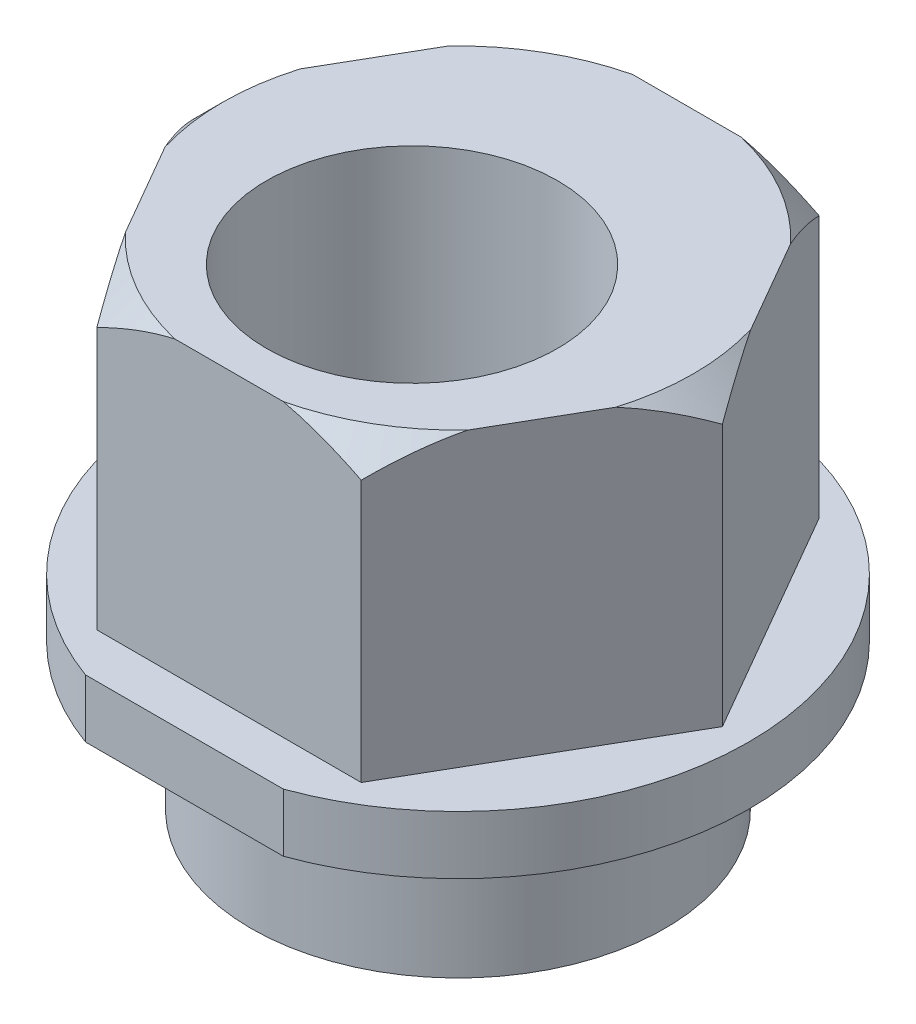
ISO-10303-21;
HEADER;
FILE_DESCRIPTION(('STEP AP214'),'2;1');
FILE_NAME('part.step','',(''),(''),'','','');
FILE_SCHEMA(('AUTOMOTIVE_DESIGN { 1 0 10303 214 1 1 1 1 }'));
ENDSEC;
DATA;
#1=APPLICATION_CONTEXT('core data for automotive mechanical design processes');
#2=APPLICATION_PROTOCOL_DEFINITION('international standard','automotive_design',2000,#1);
#3=PRODUCT_CONTEXT('',#1,'mechanical');
#4=PRODUCT('Part','Part','',(#3));
#5=PRODUCT_RELATED_PRODUCT_CATEGORY('part','',(#4));
#6=PRODUCT_DEFINITION_FORMATION('','',#4);
#7=PRODUCT_DEFINITION_CONTEXT('part definition',#1,'design');
#8=PRODUCT_DEFINITION('design','',#6,#7);
#9=PRODUCT_DEFINITION_SHAPE('','',#8);
#10=(LENGTH_UNIT() NAMED_UNIT(*) SI_UNIT(.MILLI.,.METRE.));
#11=(NAMED_UNIT(*) PLANE_ANGLE_UNIT() SI_UNIT($,.RADIAN.));
#12=(NAMED_UNIT(*) SI_UNIT($,.STERADIAN.) SOLID_ANGLE_UNIT());
#13=UNCERTAINTY_MEASURE_WITH_UNIT(LENGTH_MEASURE(1.E-05),#10,'distance_accuracy_value','');
#14=(GEOMETRIC_REPRESENTATION_CONTEXT(3) GLOBAL_UNCERTAINTY_ASSIGNED_CONTEXT((#13)) GLOBAL_UNIT_ASSIGNED_CONTEXT((#10,
#11,#12)) REPRESENTATION_CONTEXT('',''));
#15=CARTESIAN_POINT('',(0.,0.,0.));
#16=DIRECTION('',(0.,0.,1.));
#17=DIRECTION('',(1.,0.,0.));
#18=AXIS2_PLACEMENT_3D('',#15,#16,#17);
#19=CARTESIAN_POINT('',(0.,-1.,0.));
#20=DIRECTION('',(0.,1.,0.));
#21=DIRECTION('',(0.,0.,1.));
#22=AXIS2_PLACEMENT_3D('',#19,#20,#21);
#23=PLANE('',#22);
#24=CARTESIAN_POINT('',(0.,-1.,0.));
#25=DIRECTION('',(0.,1.,0.));
#26=DIRECTION('',(0.,0.,1.));
#27=AXIS2_PLACEMENT_3D('',#24,#25,#26);
#28=CIRCLE('',#27,5.);
#29=CARTESIAN_POINT('',(1.7,-1.,4.7021271782035));
#30=VERTEX_POINT('',#29);
#31=CARTESIAN_POINT('',(-1.7,-1.,4.7021271782035));
#32=VERTEX_POINT('',#31);
#33=EDGE_CURVE('E222',#30,#32,#28,.T.);
#34=ORIENTED_EDGE('',*,*,#33,.F.);
#35=DIRECTION('',(-1.,0.,0.));
#36=VECTOR('',#35,1.);
#37=CARTESIAN_POINT('',(0.,-1.,4.7021271782035));
#38=LINE('',#37,#36);
#39=EDGE_CURVE('E331',#30,#32,#38,.T.);
#40=ORIENTED_EDGE('',*,*,#39,.T.);
#41=EDGE_LOOP('',(#34,#40));
#42=FACE_BOUND('',#41,.T.);
#43=CARTESIAN_POINT('',(0.,-1.,0.));
#44=DIRECTION('',(0.,1.,0.));
#45=DIRECTION('',(0.,0.,1.));
#46=AXIS2_PLACEMENT_3D('',#43,#44,#45);
#47=CIRCLE('',#46,3.555);
#48=CARTESIAN_POINT('',(0.,-1.,3.555));
#49=VERTEX_POINT('',#48);
#50=EDGE_CURVE('E167',#49,#49,#47,.F.);
#51=ORIENTED_EDGE('',*,*,#50,.F.);
#52=EDGE_LOOP('',(#51));
#53=FACE_BOUND('',#52,.T.);
#54=ADVANCED_FACE('F35',(#42,#53),#23,.F.);
#55=CARTESIAN_POINT('',(2.27187330926118,5.,3.935));
#56=DIRECTION('',(-0.866025403784439,0.,-0.5));
#57=DIRECTION('',(-0.5,0.,0.866025403784439));
#58=AXIS2_PLACEMENT_3D('',#55,#56,#57);
#59=PLANE('',#58);
#60=DIRECTION('',(0.,-1.,0.));
#61=VECTOR('',#60,1.);
#62=CARTESIAN_POINT('',(4.54374661852235,5.,0.));
#63=LINE('',#62,#61);
#64=CARTESIAN_POINT('',(4.54374661852235,4.5,0.));
#65=VERTEX_POINT('',#64);
#66=CARTESIAN_POINT('',(4.54374661852235,0.,0.));
#67=VERTEX_POINT('',#66);
#68=EDGE_CURVE('E164',#65,#67,#63,.T.);
#69=ORIENTED_EDGE('',*,*,#68,.F.);
#70=CARTESIAN_POINT('',(6.12736327266163,2.33046829888115,-2.74290450468147));
#71=CARTESIAN_POINT('',(6.07348339276709,2.4177650828994,-2.64958181519841));
#72=CARTESIAN_POINT('',(6.01938921555573,2.50453762285222,-2.55588795187471));
#73=CARTESIAN_POINT('',(5.91069789973588,2.67683309661582,-2.36762907053321));
#74=CARTESIAN_POINT('',(5.85610071578471,2.76235591593962,-2.27306397397959));
#75=CARTESIAN_POINT('',(5.74620735938589,2.9321379387506,-2.08272309728255));
#76=CARTESIAN_POINT('',(5.6909098259844,3.01639362513631,-1.98694495989795));
#77=CARTESIAN_POINT('',(5.57966030231228,3.18315508159383,-1.79425513258));
#78=CARTESIAN_POINT('',(5.52370832991605,3.26566089928668,-1.69734347360602));
#79=CARTESIAN_POINT('',(5.40948255505868,3.43085092459455,-1.49949862801914));
#80=CARTESIAN_POINT('',(5.3511874452437,3.51347634106705,-1.3985285359868));
#81=CARTESIAN_POINT('',(5.23367321649109,3.67605365317037,-1.194987921175));
#82=CARTESIAN_POINT('',(5.17445413325307,3.75600565172091,-1.09241746022911));
#83=CARTESIAN_POINT('',(5.05499257757878,3.9125743398257,-0.885503976250002));
#84=CARTESIAN_POINT('',(4.99475102957391,3.98919384008597,-0.78116255437897));
#85=CARTESIAN_POINT('',(4.873034492307,4.1383918042904,-0.570343327711337));
#86=CARTESIAN_POINT('',(4.81155966257741,4.21097078637303,-0.463865799233039));
#87=CARTESIAN_POINT('',(4.68581480841085,4.35265115676022,-0.246069323026223));
#88=CARTESIAN_POINT('',(4.62151303943029,4.42164059850529,-0.134695392135335));
#89=CARTESIAN_POINT('',(4.4912183922476,4.55301635986169,0.090981556739347));
#90=CARTESIAN_POINT('',(4.42522527529575,4.61540174079966,0.205284988249787));
#91=CARTESIAN_POINT('',(4.29176890522431,4.73150823576122,0.436438201807242));
#92=CARTESIAN_POINT('',(4.22431561588303,4.78527468558276,0.553270726083977));
#93=CARTESIAN_POINT('',(4.08756303909753,4.88247623364584,0.790133137142428));
#94=CARTESIAN_POINT('',(4.01826431274338,4.92591443311341,0.910162052087628));
#95=CARTESIAN_POINT('',(3.89160680975576,4.99299560676046,1.129539282422));
#96=CARTESIAN_POINT('',(3.83454175212893,5.01884439579798,1.22837886156851));
#97=CARTESIAN_POINT('',(3.71955042243969,5.06126068823275,1.42754968702018));
#98=CARTESIAN_POINT('',(3.66162427680432,5.0778295405829,1.52788071434728));
#99=CARTESIAN_POINT('',(3.54536540774452,5.10083438466152,1.72924698238935));
#100=CARTESIAN_POINT('',(3.4870335640049,5.1072879053957,1.83028069944554));
#101=CARTESIAN_POINT('',(3.37031281221754,5.10976287991731,2.03244697183888));
#102=CARTESIAN_POINT('',(3.31192390350574,5.10578421082689,2.13357952832621));
#103=CARTESIAN_POINT('',(3.19571069696838,5.08764038060559,2.33486670655941));
#104=CARTESIAN_POINT('',(3.13788528988516,5.07350318473267,2.43502324959591));
#105=CARTESIAN_POINT('',(3.02300572590152,5.03579603444199,2.63400049116693));
#106=CARTESIAN_POINT('',(2.96595175572664,5.01222383709666,2.73282086628335));
#107=CARTESIAN_POINT('',(2.85271904802042,4.95661618256865,2.9289456691091));
#108=CARTESIAN_POINT('',(2.79654337792266,4.92455603960202,3.02624478386765));
#109=CARTESIAN_POINT('',(2.68537248742994,4.85318593152667,3.21879841452373));
#110=CARTESIAN_POINT('',(2.63037720983353,4.81387631861451,3.31405302949706));
#111=CARTESIAN_POINT('',(2.5019161833033,4.71383121159169,3.53655405423988));
#112=CARTESIAN_POINT('',(2.42896022795634,4.65048731772351,3.66291747561553));
#113=CARTESIAN_POINT('',(2.28511505424096,4.51496245516658,3.91206462491415));
#114=CARTESIAN_POINT('',(2.2142269607044,4.44277678394606,4.03484640457117));
#115=CARTESIAN_POINT('',(2.07416708594693,4.29140781010891,4.27743722375284));
#116=CARTESIAN_POINT('',(2.00499919286836,4.21221022636325,4.39723952881742));
#117=CARTESIAN_POINT('',(1.86828970424628,4.04847541244671,4.63402730898762));
#118=CARTESIAN_POINT('',(1.80074782327538,3.96393912900212,4.75101327846797));
#119=CARTESIAN_POINT('',(1.6667324101583,3.790255628053,4.9831347829841));
#120=CARTESIAN_POINT('',(1.60026513983173,3.70108917509827,5.09825947223014));
#121=CARTESIAN_POINT('',(1.46849790545969,3.51936003005431,5.32648701693534));
#122=CARTESIAN_POINT('',(1.40319803917282,3.42679705550268,5.43958970307165));
#123=CARTESIAN_POINT('',(1.27366225353528,3.23904020589262,5.66395226519422));
#124=CARTESIAN_POINT('',(1.20942525212282,3.14384930831284,5.77521401536649));
#125=CARTESIAN_POINT('',(1.08179181966025,2.9512386314917,5.99628160513605));
#126=CARTESIAN_POINT('',(1.01839540535985,2.85381880794148,6.10608741572204));
#127=CARTESIAN_POINT('',(0.910409016945997,2.6853578347565,6.2931253269807));
#128=CARTESIAN_POINT('',(0.865642352807006,2.61476846228915,6.3706634637548));
#129=CARTESIAN_POINT('',(0.776622094234247,2.47305833440251,6.52485107450574));
#130=CARTESIAN_POINT('',(0.732367142810404,2.40194099006958,6.60150289885833));
#131=CARTESIAN_POINT('',(0.688256655121896,2.33046829888115,6.67790450468147));
#132=B_SPLINE_CURVE_WITH_KNOTS('',3,(#70,#71,#72,#73,#74,#75,#76,#77,#78,#79,#80,#81,#82,#83,
#84,#85,#86,#87,#88,#89,#90,#91,#92,#93,#94,#95,#96,#97,#98,#99,#100,#101,#102,#103,#104,#105,
#106,#107,#108,#109,#110,#111,#112,#113,#114,#115,#116,#117,#118,#119,#120,#121,#122,#123,#124,
#125,#126,#127,#128,#129,#130,#131),.UNSPECIFIED.,.F.,.F.,(4,2,2,2,2,2,2,2,2,2,2,2,2,2,2,2,2,2,
2,2,2,2,2,2,2,2,2,2,2,2,4),(0.,0.416050988652375,0.832139855784054,1.24922530063749,
1.6662993802975,2.09496685038955,2.52361779884089,2.95189991005181,3.38012697311563,
3.81779500231414,4.25552515650994,4.69087140580247,5.12608676971888,5.4768138337239,
5.82748990199696,6.17755760407587,6.52762942952254,6.87674122143841,7.22593605499141,
7.5761578380004,7.92636261087879,8.40316579002672,8.88022366888807,9.35827656071276,
9.83624491486482,10.316388748245,10.7965726023688,11.2762330860941,11.7559031133002,
12.0979389750605,12.4385584137849),.UNSPECIFIED.);
#133=CARTESIAN_POINT('',(3.87355176865353,5.,1.1608115309438));
#134=VERTEX_POINT('',#133);
#135=EDGE_CURVE('E311',#65,#134,#132,.T.);
#136=ORIENTED_EDGE('',*,*,#135,.T.);
#137=DIRECTION('',(0.5,0.,-0.866025403784439));
#138=VECTOR('',#137,1.);
#139=CARTESIAN_POINT('',(2.27187330926118,5.,3.935));
#140=LINE('',#139,#138);
#141=CARTESIAN_POINT('',(2.94206815913,5.,2.7741884690562));
#142=VERTEX_POINT('',#141);
#143=EDGE_CURVE('E234',#142,#134,#140,.T.);
#144=ORIENTED_EDGE('',*,*,#143,.F.);
#145=CARTESIAN_POINT('',(2.27187330926118,4.5,3.935));
#146=VERTEX_POINT('',#145);
#147=EDGE_CURVE('E251',#142,#146,#132,.T.);
#148=ORIENTED_EDGE('',*,*,#147,.T.);
#149=DIRECTION('',(0.,-1.,0.));
#150=VECTOR('',#149,1.);
#151=CARTESIAN_POINT('',(2.27187330926118,5.,3.935));
#152=LINE('',#151,#150);
#153=CARTESIAN_POINT('',(2.27187330926118,0.,3.935));
#154=VERTEX_POINT('',#153);
#155=EDGE_CURVE('E218',#146,#154,#152,.T.);
#156=ORIENTED_EDGE('',*,*,#155,.T.);
#157=DIRECTION('',(0.5,0.,-0.866025403784439));
#158=VECTOR('',#157,1.);
#159=CARTESIAN_POINT('',(2.27187330926118,0.,3.935));
#160=LINE('',#159,#158);
#161=EDGE_CURVE('E219',#154,#67,#160,.T.);
#162=ORIENTED_EDGE('',*,*,#161,.T.);
#163=EDGE_LOOP('',(#69,#136,#144,#148,#156,#162));
#164=FACE_BOUND('',#163,.T.);
#165=ADVANCED_FACE('F37',(#164),#59,.F.);
#166=CARTESIAN_POINT('',(4.54374661852235,5.,0.));
#167=DIRECTION('',(-0.866025403784438,0.,0.5));
#168=DIRECTION('',(0.5,0.,0.866025403784438));
#169=AXIS2_PLACEMENT_3D('',#166,#167,#168);
#170=PLANE('',#169);
#171=DIRECTION('',(0.,-1.,0.));
#172=VECTOR('',#171,1.);
#173=CARTESIAN_POINT('',(2.27187330926118,5.,-3.935));
#174=LINE('',#173,#172);
#175=CARTESIAN_POINT('',(2.27187330926118,4.5,-3.935));
#176=VERTEX_POINT('',#175);
#177=CARTESIAN_POINT('',(2.27187330926118,0.,-3.935));
#178=VERTEX_POINT('',#177);
#179=EDGE_CURVE('E153',#176,#178,#174,.T.);
#180=ORIENTED_EDGE('',*,*,#179,.F.);
#181=CARTESIAN_POINT('',(0.688256655121894,2.33046829888116,-6.67790450468146));
#182=CARTESIAN_POINT('',(0.742136535016436,2.4177650828994,-6.58458181519841));
#183=CARTESIAN_POINT('',(0.796230712227795,2.50453762285222,-6.4908879518747));
#184=CARTESIAN_POINT('',(0.904922028047648,2.67683309661582,-6.3026290705332));
#185=CARTESIAN_POINT('',(0.959519211998818,2.76235591593963,-6.20806397397959));
#186=CARTESIAN_POINT('',(1.06941256839764,2.93213793875061,-6.01772309728255));
#187=CARTESIAN_POINT('',(1.12471010179913,3.01639362513632,-5.92194495989794));
#188=CARTESIAN_POINT('',(1.23595962547125,3.18315508159383,-5.72925513257999));
#189=CARTESIAN_POINT('',(1.29191159786749,3.26566089928668,-5.63234347360602));
#190=CARTESIAN_POINT('',(1.40613737272485,3.43085092459456,-5.43449862801913));
#191=CARTESIAN_POINT('',(1.46443248253983,3.51347634106706,-5.33352853598679));
#192=CARTESIAN_POINT('',(1.58194671129244,3.67605365317038,-5.12998792117499));
#193=CARTESIAN_POINT('',(1.64116579453046,3.75600565172092,-5.0274174602291));
#194=CARTESIAN_POINT('',(1.76062735020476,3.9125743398257,-4.82050397624999));
#195=CARTESIAN_POINT('',(1.82086889820963,3.98919384008598,-4.71616255437896));
#196=CARTESIAN_POINT('',(1.94258543547653,4.1383918042904,-4.50534332771133));
#197=CARTESIAN_POINT('',(2.00406026520612,4.21097078637303,-4.39886579923303));
#198=CARTESIAN_POINT('',(2.12980511937268,4.35265115676022,-4.18106932302621));
#199=CARTESIAN_POINT('',(2.19410688835324,4.4216405985053,-4.06969539213533));
#200=CARTESIAN_POINT('',(2.32440153553593,4.5530163598617,-3.84401844326064));
#201=CARTESIAN_POINT('',(2.39039465248778,4.61540174079966,-3.7297150117502));
#202=CARTESIAN_POINT('',(2.52385102255923,4.73150823576123,-3.49856179819275));
#203=CARTESIAN_POINT('',(2.5913043119005,4.78527468558276,-3.38172927391602));
#204=CARTESIAN_POINT('',(2.728056888686,4.88247623364584,-3.14486686285757));
#205=CARTESIAN_POINT('',(2.79735561504015,4.92591443311342,-3.02483794791237));
#206=CARTESIAN_POINT('',(2.92401311802778,4.99299560676046,-2.805460717578));
#207=CARTESIAN_POINT('',(2.98107817565461,5.01884439579799,-2.70662113843148));
#208=CARTESIAN_POINT('',(3.09606950534385,5.06126068823276,-2.50745031297981));
#209=CARTESIAN_POINT('',(3.15399565097922,5.0778295405829,-2.40711928565272));
#210=CARTESIAN_POINT('',(3.27025452003902,5.10083438466152,-2.20575301761065));
#211=CARTESIAN_POINT('',(3.32858636377864,5.1072879053957,-2.10471930055446));
#212=CARTESIAN_POINT('',(3.445307115566,5.10976287991731,-1.90255302816112));
#213=CARTESIAN_POINT('',(3.50369602427779,5.10578421082689,-1.80142047167379));
#214=CARTESIAN_POINT('',(3.61990923081515,5.08764038060559,-1.60013329344058));
#215=CARTESIAN_POINT('',(3.67773463789837,5.07350318473267,-1.49997675040409));
#216=CARTESIAN_POINT('',(3.79261420188202,5.03579603444199,-1.30099950883306));
#217=CARTESIAN_POINT('',(3.8496681720569,5.01222383709666,-1.20217913371665));
#218=CARTESIAN_POINT('',(3.96290087976311,4.95661618256865,-1.00605433089089));
#219=CARTESIAN_POINT('',(4.01907654986087,4.92455603960202,-0.908755216132345));
#220=CARTESIAN_POINT('',(4.13024744035359,4.85318593152667,-0.716201585476272));
#221=CARTESIAN_POINT('',(4.18524271795,4.81387631861451,-0.620946970502936));
#222=CARTESIAN_POINT('',(4.31370374448024,4.71383121159169,-0.398445945760117));
#223=CARTESIAN_POINT('',(4.38665969982719,4.6504873177235,-0.272082524384468));
#224=CARTESIAN_POINT('',(4.53050487354258,4.51496245516658,-0.0229353750858439));
#225=CARTESIAN_POINT('',(4.60139296707914,4.44277678394605,0.0998464045711766));
#226=CARTESIAN_POINT('',(4.74145284183661,4.2914078101089,0.342437223752842));
#227=CARTESIAN_POINT('',(4.81062073491518,4.21221022636324,0.462239528817422));
#228=CARTESIAN_POINT('',(4.94733022353726,4.0484754124467,0.699027308987622));
#229=CARTESIAN_POINT('',(5.01487210450815,3.96393912900211,0.81601327846798));
#230=CARTESIAN_POINT('',(5.14888751762524,3.79025562805299,1.04813478298411));
#231=CARTESIAN_POINT('',(5.21535478795181,3.70108917509827,1.16325947223014));
#232=CARTESIAN_POINT('',(5.34712202232385,3.5193600300543,1.39148701693534));
#233=CARTESIAN_POINT('',(5.41242188861072,3.42679705550267,1.50458970307166));
#234=CARTESIAN_POINT('',(5.54195767424825,3.23904020589262,1.72895226519422));
#235=CARTESIAN_POINT('',(5.60619467566072,3.14384930831283,1.84021401536649));
#236=CARTESIAN_POINT('',(5.73382810812329,2.95123863149169,2.06128160513606));
#237=CARTESIAN_POINT('',(5.79722452242369,2.85381880794147,2.17108741572204));
#238=CARTESIAN_POINT('',(5.90521091083754,2.68535783475649,2.3581253269807));
#239=CARTESIAN_POINT('',(5.94997757497653,2.61476846228915,2.43566346375481));
#240=CARTESIAN_POINT('',(6.03899783354929,2.47305833440251,2.58985107450574));
#241=CARTESIAN_POINT('',(6.08325278497313,2.40194099006958,2.66650289885833));
#242=CARTESIAN_POINT('',(6.12736327266164,2.33046829888115,2.74290450468146));
#243=B_SPLINE_CURVE_WITH_KNOTS('',3,(#181,#182,#183,#184,#185,#186,#187,#188,#189,#190,#191,
#192,#193,#194,#195,#196,#197,#198,#199,#200,#201,#202,#203,#204,#205,#206,#207,#208,#209,#210,
#211,#212,#213,#214,#215,#216,#217,#218,#219,#220,#221,#222,#223,#224,#225,#226,#227,#228,#229,
#230,#231,#232,#233,#234,#235,#236,#237,#238,#239,#240,#241,#242),.UNSPECIFIED.,.F.,.F.,(4,2,2,
2,2,2,2,2,2,2,2,2,2,2,2,2,2,2,2,2,2,2,2,2,2,2,2,2,2,2,4),(0.,0.416050988652376,
0.832139855784055,1.24922530063749,1.66629938029751,2.09496685038956,2.5236177988409,
2.95189991005182,3.38012697311563,3.81779500231415,4.25552515650994,4.69087140580247,
5.12608676971889,5.4768138337239,5.82748990199696,6.17755760407587,6.52762942952254,
6.87674122143841,7.22593605499141,7.57615783800039,7.92636261087879,8.40316579002672,
8.88022366888807,9.35827656071276,9.83624491486482,10.316388748245,10.7965726023688,
11.2762330860941,11.7559031133002,12.0979389750605,12.4385584137849),.UNSPECIFIED.);
#244=CARTESIAN_POINT('',(2.94206815913,5.,-2.7741884690562));
#245=VERTEX_POINT('',#244);
#246=EDGE_CURVE('E136',#176,#245,#243,.T.);
#247=ORIENTED_EDGE('',*,*,#246,.T.);
#248=DIRECTION('',(-0.5,0.,-0.866025403784438));
#249=VECTOR('',#248,1.);
#250=CARTESIAN_POINT('',(4.54374661852235,5.,0.));
#251=LINE('',#250,#249);
#252=CARTESIAN_POINT('',(3.87355176865353,5.,-1.1608115309438));
#253=VERTEX_POINT('',#252);
#254=EDGE_CURVE('E212',#253,#245,#251,.T.);
#255=ORIENTED_EDGE('',*,*,#254,.F.);
#256=EDGE_CURVE('E146',#253,#65,#243,.T.);
#257=ORIENTED_EDGE('',*,*,#256,.T.);
#258=ORIENTED_EDGE('',*,*,#68,.T.);
#259=DIRECTION('',(-0.5,0.,-0.866025403784438));
#260=VECTOR('',#259,1.);
#261=CARTESIAN_POINT('',(4.54374661852235,0.,0.));
#262=LINE('',#261,#260);
#263=EDGE_CURVE('E163',#67,#178,#262,.T.);
#264=ORIENTED_EDGE('',*,*,#263,.T.);
#265=EDGE_LOOP('',(#180,#247,#255,#257,#258,#264));
#266=FACE_BOUND('',#265,.T.);
#267=ADVANCED_FACE('F161',(#266),#170,.F.);
#268=CARTESIAN_POINT('',(2.27187330926118,5.,-3.935));
#269=DIRECTION('',(0.,0.,1.));
#270=DIRECTION('',(1.,0.,0.));
#271=AXIS2_PLACEMENT_3D('',#268,#269,#270);
#272=PLANE('',#271);
#273=DIRECTION('',(0.,-1.,0.));
#274=VECTOR('',#273,1.);
#275=CARTESIAN_POINT('',(-2.27187330926118,5.,-3.935));
#276=LINE('',#275,#274);
#277=CARTESIAN_POINT('',(-2.27187330926118,4.5,-3.935));
#278=VERTEX_POINT('',#277);
#279=CARTESIAN_POINT('',(-2.27187330926118,0.,-3.935));
#280=VERTEX_POINT('',#279);
#281=EDGE_CURVE('E165',#278,#280,#276,.T.);
#282=ORIENTED_EDGE('',*,*,#281,.F.);
#283=CARTESIAN_POINT('',(-5.01477781394264,2.6694057488158,-3.935));
#284=CARTESIAN_POINT('',(-4.90228240032233,2.75789162999437,-3.935));
#285=CARTESIAN_POINT('',(-4.78924605492269,2.84569863662638,-3.935));
#286=CARTESIAN_POINT('',(-4.56188241632701,3.01966288534844,-3.935));
#287=CARTESIAN_POINT('',(-4.44755491307628,3.10581985266844,-3.935));
#288=CARTESIAN_POINT('',(-4.21685222046402,3.27659538663721,-3.935));
#289=CARTESIAN_POINT('',(-4.10046957789372,3.36120391114583,-3.935));
#290=CARTESIAN_POINT('',(-3.86599418351296,3.52801066974508,-3.935));
#291=CARTESIAN_POINT('',(-3.74790151420127,3.61020901953759,-3.935));
#292=CARTESIAN_POINT('',(-3.50380543280417,3.77568927594522,-3.935));
#293=CARTESIAN_POINT('',(-3.3777005297054,3.85882204730453,-3.935));
#294=CARTESIAN_POINT('',(-3.12293409141574,4.0210686075328,-3.935));
#295=CARTESIAN_POINT('',(-2.99427277147477,4.10018273279293,-3.935));
#296=CARTESIAN_POINT('',(-2.7342134500717,4.25322326602883,-3.935));
#297=CARTESIAN_POINT('',(-2.60282112402671,4.32715926211431,-3.935));
#298=CARTESIAN_POINT('',(-2.33665993470769,4.46865096658867,-3.935));
#299=CARTESIAN_POINT('',(-2.20189200633557,4.53620841737975,-3.935));
#300=CARTESIAN_POINT('',(-1.94277039794665,4.65662539379787,-3.935));
#301=CARTESIAN_POINT('',(-1.81879024517606,4.7102827638368,-3.935));
#302=CARTESIAN_POINT('',(-1.56760322182998,4.80956431437058,-3.935));
#303=CARTESIAN_POINT('',(-1.4403960426367,4.8551877231961,-3.935));
#304=CARTESIAN_POINT('',(-1.18430895439847,4.93616339546024,-3.935));
#305=CARTESIAN_POINT('',(-1.05546474171029,4.97162701315895,-3.935));
#306=CARTESIAN_POINT('',(-0.795188728182397,5.03120060018271,-3.935));
#307=CARTESIAN_POINT('',(-0.663757985336443,5.05531511515621,-3.935));
#308=CARTESIAN_POINT('',(-0.39667530812576,5.09105643721047,-3.935));
#309=CARTESIAN_POINT('',(-0.260990364554486,5.10244193256667,-3.935));
#310=CARTESIAN_POINT('',(0.0108256286758382,5.11107629854814,-3.935));
#311=CARTESIAN_POINT('',(0.146956639108313,5.10832638056083,-3.935));
#312=CARTESIAN_POINT('',(0.418619878870053,5.08887050209526,-3.935));
#313=CARTESIAN_POINT('',(0.554148970208934,5.0721215602934,-3.935));
#314=CARTESIAN_POINT('',(0.822982454746628,5.02579152850102,-3.935));
#315=CARTESIAN_POINT('',(0.956286242224141,4.99620700199297,-3.935));
#316=CARTESIAN_POINT('',(1.26105655280132,4.91498323631563,-3.935));
#317=CARTESIAN_POINT('',(1.43144793684183,4.85934235740488,-3.935));
#318=CARTESIAN_POINT('',(1.76659971199313,4.73318715507506,-3.935));
#319=CARTESIAN_POINT('',(1.93135663408204,4.66266385383244,-3.935));
#320=CARTESIAN_POINT('',(2.25670464302017,4.50985567629177,-3.935));
#321=CARTESIAN_POINT('',(2.41725700907644,4.42748946751823,-3.935));
#322=CARTESIAN_POINT('',(2.7335996666453,4.25424890954647,-3.935));
#323=CARTESIAN_POINT('',(2.88939106725242,4.16337656225559,-3.935));
#324=CARTESIAN_POINT('',(3.2171018287942,3.96289685347115,-3.935));
#325=CARTESIAN_POINT('',(3.38846902004868,3.85239290462363,-3.935));
#326=CARTESIAN_POINT('',(3.7271209143155,3.62526903861077,-3.935));
#327=CARTESIAN_POINT('',(3.89440474117752,3.50864782550207,-3.935));
#328=CARTESIAN_POINT('',(4.22200861608271,3.27340163426143,-3.935));
#329=CARTESIAN_POINT('',(4.38240091884256,3.15487687320021,-3.935));
#330=CARTESIAN_POINT('',(4.6209837589724,2.97456068361506,-3.935));
#331=CARTESIAN_POINT('',(4.70015123515769,2.91405422097405,-3.935));
#332=CARTESIAN_POINT('',(4.85789331048121,2.79227931530866,-3.935));
#333=CARTESIAN_POINT('',(4.93646793238964,2.73101090179094,-3.935));
#334=CARTESIAN_POINT('',(5.01477781394264,2.6694057488158,-3.935));
#335=B_SPLINE_CURVE_WITH_KNOTS('',3,(#283,#284,#285,#286,#287,#288,#289,#290,#291,#292,#293,
#294,#295,#296,#297,#298,#299,#300,#301,#302,#303,#304,#305,#306,#307,#308,#309,#310,#311,#312,
#313,#314,#315,#316,#317,#318,#319,#320,#321,#322,#323,#324,#325,#326,#327,#328,#329,#330,#331,
#332,#333,#334),.UNSPECIFIED.,.F.,.F.,(4,2,2,2,2,2,2,2,2,2,2,2,2,2,2,2,2,2,2,2,2,2,2,2,2,4),(0.,
0.429382623340998,0.858836137877717,1.29047192805164,1.72208696325132,2.17515026344406,
2.62817557609088,3.08033856015113,3.53237766908385,3.9374314291705,4.34252407384557,
4.74299021725164,5.14329582542998,5.55106798246257,5.95880519450876,6.36779890408527,
6.77690218266532,7.31369645202257,7.85081547305105,8.39181700182992,8.932691525285,
9.54423171138721,10.15590197977,10.7541421331558,11.0530644250241,11.35197517691),.UNSPECIFIED.);
#336=CARTESIAN_POINT('',(-0.931483609523527,5.,-3.935));
#337=VERTEX_POINT('',#336);
#338=EDGE_CURVE('E158',#278,#337,#335,.T.);
#339=ORIENTED_EDGE('',*,*,#338,.T.);
#340=DIRECTION('',(-1.,0.,0.));
#341=VECTOR('',#340,1.);
#342=CARTESIAN_POINT('',(2.27187330926118,5.,-3.935));
#343=LINE('',#342,#341);
#344=CARTESIAN_POINT('',(0.931483609523526,5.,-3.935));
#345=VERTEX_POINT('',#344);
#346=EDGE_CURVE('E157',#345,#337,#343,.T.);
#347=ORIENTED_EDGE('',*,*,#346,.F.);
#348=EDGE_CURVE('E139',#345,#176,#335,.T.);
#349=ORIENTED_EDGE('',*,*,#348,.T.);
#350=ORIENTED_EDGE('',*,*,#179,.T.);
#351=DIRECTION('',(-1.,0.,0.));
#352=VECTOR('',#351,1.);
#353=CARTESIAN_POINT('',(2.27187330926118,0.,-3.935));
#354=LINE('',#353,#352);
#355=EDGE_CURVE('E224',#178,#280,#354,.T.);
#356=ORIENTED_EDGE('',*,*,#355,.T.);
#357=EDGE_LOOP('',(#282,#339,#347,#349,#350,#356));
#358=FACE_BOUND('',#357,.T.);
#359=ADVANCED_FACE('F151',(#358),#272,.F.);
#360=CARTESIAN_POINT('',(-2.27187330926118,5.,-3.935));
#361=DIRECTION('',(0.866025403784438,0.,0.5));
#362=DIRECTION('',(0.5,0.,-0.866025403784439));
#363=AXIS2_PLACEMENT_3D('',#360,#361,#362);
#364=PLANE('',#363);
#365=DIRECTION('',(0.,-1.,0.));
#366=VECTOR('',#365,1.);
#367=CARTESIAN_POINT('',(-4.54374661852235,5.,0.));
#368=LINE('',#367,#366);
#369=CARTESIAN_POINT('',(-4.54374661852235,4.5,0.));
#370=VERTEX_POINT('',#369);
#371=CARTESIAN_POINT('',(-4.54374661852235,0.,0.));
#372=VERTEX_POINT('',#371);
#373=EDGE_CURVE('E169',#370,#372,#368,.T.);
#374=ORIENTED_EDGE('',*,*,#373,.F.);
#375=CARTESIAN_POINT('',(-6.12736327266164,2.33046829888115,2.74290450468147));
#376=CARTESIAN_POINT('',(-6.07348339276709,2.4177650828994,2.64958181519841));
#377=CARTESIAN_POINT('',(-6.01938921555574,2.50453762285222,2.5558879518747));
#378=CARTESIAN_POINT('',(-5.91069789973588,2.67683309661582,2.3676290705332));
#379=CARTESIAN_POINT('',(-5.85610071578471,2.76235591593963,2.27306397397959));
#380=CARTESIAN_POINT('',(-5.74620735938589,2.9321379387506,2.08272309728255));
#381=CARTESIAN_POINT('',(-5.6909098259844,3.01639362513631,1.98694495989795));
#382=CARTESIAN_POINT('',(-5.57966030231228,3.18315508159383,1.79425513257999));
#383=CARTESIAN_POINT('',(-5.52370832991604,3.26566089928668,1.69734347360602));
#384=CARTESIAN_POINT('',(-5.40948255505868,3.43085092459455,1.49949862801913));
#385=CARTESIAN_POINT('',(-5.3511874452437,3.51347634106705,1.39852853598679));
#386=CARTESIAN_POINT('',(-5.23367321649109,3.67605365317037,1.19498792117499));
#387=CARTESIAN_POINT('',(-5.17445413325307,3.75600565172092,1.0924174602291));
#388=CARTESIAN_POINT('',(-5.05499257757878,3.9125743398257,0.885503976249998));
#389=CARTESIAN_POINT('',(-4.99475102957391,3.98919384008598,0.781162554378965));
#390=CARTESIAN_POINT('',(-4.873034492307,4.1383918042904,0.570343327711332));
#391=CARTESIAN_POINT('',(-4.81155966257741,4.21097078637303,0.463865799233036));
#392=CARTESIAN_POINT('',(-4.68581480841085,4.35265115676022,0.24606932302622));
#393=CARTESIAN_POINT('',(-4.62151303943029,4.42164059850529,0.134695392135332));
#394=CARTESIAN_POINT('',(-4.4912183922476,4.55301635986169,-0.0909815567393509));
#395=CARTESIAN_POINT('',(-4.42522527529575,4.61540174079966,-0.205284988249791));
#396=CARTESIAN_POINT('',(-4.2917689052243,4.73150823576122,-0.436438201807246));
#397=CARTESIAN_POINT('',(-4.22431561588303,4.78527468558276,-0.553270726083981));
#398=CARTESIAN_POINT('',(-4.08756303909753,4.88247623364584,-0.790133137142432));
#399=CARTESIAN_POINT('',(-4.01826431274338,4.92591443311341,-0.910162052087631));
#400=CARTESIAN_POINT('',(-3.89160680975576,4.99299560676046,-1.129539282422));
#401=CARTESIAN_POINT('',(-3.83454175212893,5.01884439579798,-1.22837886156851));
#402=CARTESIAN_POINT('',(-3.71955042243968,5.06126068823275,-1.42754968702018));
#403=CARTESIAN_POINT('',(-3.66162427680432,5.0778295405829,-1.52788071434728));
#404=CARTESIAN_POINT('',(-3.54536540774451,5.10083438466152,-1.72924698238935));
#405=CARTESIAN_POINT('',(-3.48703356400489,5.1072879053957,-1.83028069944554));
#406=CARTESIAN_POINT('',(-3.37031281221754,5.10976287991731,-2.03244697183888));
#407=CARTESIAN_POINT('',(-3.31192390350574,5.10578421082689,-2.13357952832621));
#408=CARTESIAN_POINT('',(-3.19571069696838,5.08764038060559,-2.33486670655941));
#409=CARTESIAN_POINT('',(-3.13788528988516,5.07350318473267,-2.43502324959591));
#410=CARTESIAN_POINT('',(-3.02300572590152,5.03579603444199,-2.63400049116693));
#411=CARTESIAN_POINT('',(-2.96595175572664,5.01222383709666,-2.73282086628335));
#412=CARTESIAN_POINT('',(-2.85271904802042,4.95661618256865,-2.9289456691091));
#413=CARTESIAN_POINT('',(-2.79654337792266,4.92455603960202,-3.02624478386765));
#414=CARTESIAN_POINT('',(-2.68537248742994,4.85318593152667,-3.21879841452372));
#415=CARTESIAN_POINT('',(-2.63037720983353,4.81387631861451,-3.31405302949706));
#416=CARTESIAN_POINT('',(-2.5019161833033,4.71383121159169,-3.53655405423988));
#417=CARTESIAN_POINT('',(-2.42896022795634,4.65048731772351,-3.66291747561553));
#418=CARTESIAN_POINT('',(-2.28511505424096,4.51496245516658,-3.91206462491415));
#419=CARTESIAN_POINT('',(-2.21422696070439,4.44277678394606,-4.03484640457117));
#420=CARTESIAN_POINT('',(-2.07416708594693,4.29140781010891,-4.27743722375283));
#421=CARTESIAN_POINT('',(-2.00499919286836,4.21221022636325,-4.39723952881741));
#422=CARTESIAN_POINT('',(-1.86828970424628,4.04847541244671,-4.63402730898761));
#423=CARTESIAN_POINT('',(-1.80074782327538,3.96393912900212,-4.75101327846797));
#424=CARTESIAN_POINT('',(-1.6667324101583,3.790255628053,-4.9831347829841));
#425=CARTESIAN_POINT('',(-1.60026513983173,3.70108917509828,-5.09825947223013));
#426=CARTESIAN_POINT('',(-1.46849790545969,3.51936003005432,-5.32648701693533));
#427=CARTESIAN_POINT('',(-1.40319803917282,3.42679705550269,-5.43958970307165));
#428=CARTESIAN_POINT('',(-1.27366225353529,3.23904020589263,-5.66395226519421));
#429=CARTESIAN_POINT('',(-1.20942525212282,3.14384930831284,-5.77521401536648));
#430=CARTESIAN_POINT('',(-1.08179181966026,2.95123863149171,-5.99628160513604));
#431=CARTESIAN_POINT('',(-1.01839540535985,2.85381880794148,-6.10608741572203));
#432=CARTESIAN_POINT('',(-0.910409016945998,2.68535783475651,-6.29312532698069));
#433=CARTESIAN_POINT('',(-0.865642352807006,2.61476846228916,-6.3706634637548));
#434=CARTESIAN_POINT('',(-0.776622094234247,2.47305833440251,-6.52485107450573));
#435=CARTESIAN_POINT('',(-0.732367142810403,2.40194099006959,-6.60150289885832));
#436=CARTESIAN_POINT('',(-0.688256655121894,2.33046829888116,-6.67790450468146));
#437=B_SPLINE_CURVE_WITH_KNOTS('',3,(#375,#376,#377,#378,#379,#380,#381,#382,#383,#384,#385,
#386,#387,#388,#389,#390,#391,#392,#393,#394,#395,#396,#397,#398,#399,#400,#401,#402,#403,#404,
#405,#406,#407,#408,#409,#410,#411,#412,#413,#414,#415,#416,#417,#418,#419,#420,#421,#422,#423,
#424,#425,#426,#427,#428,#429,#430,#431,#432,#433,#434,#435,#436),.UNSPECIFIED.,.F.,.F.,(4,2,2,
2,2,2,2,2,2,2,2,2,2,2,2,2,2,2,2,2,2,2,2,2,2,2,2,2,2,2,4),(0.,0.416050988652376,
0.832139855784055,1.24922530063749,1.66629938029751,2.09496685038956,2.5236177988409,
2.95189991005181,3.38012697311563,3.81779500231415,4.25552515650994,4.69087140580247,
5.12608676971889,5.4768138337239,5.82748990199696,6.17755760407587,6.52762942952254,
6.87674122143841,7.22593605499141,7.57615783800039,7.92636261087879,8.40316579002672,
8.88022366888806,9.35827656071275,9.83624491486481,10.316388748245,10.7965726023688,
11.276233086094,11.7559031133002,12.0979389750605,12.4385584137849),.UNSPECIFIED.);
#438=CARTESIAN_POINT('',(-3.87355176865353,5.,-1.1608115309438));
#439=VERTEX_POINT('',#438);
#440=EDGE_CURVE('E192',#370,#439,#437,.T.);
#441=ORIENTED_EDGE('',*,*,#440,.T.);
#442=DIRECTION('',(-0.5,0.,0.866025403784439));
#443=VECTOR('',#442,1.);
#444=CARTESIAN_POINT('',(-2.27187330926118,5.,-3.935));
#445=LINE('',#444,#443);
#446=CARTESIAN_POINT('',(-2.94206815913,5.,-2.7741884690562));
#447=VERTEX_POINT('',#446);
#448=EDGE_CURVE('E202',#447,#439,#445,.T.);
#449=ORIENTED_EDGE('',*,*,#448,.F.);
#450=EDGE_CURVE('E204',#447,#278,#437,.T.);
#451=ORIENTED_EDGE('',*,*,#450,.T.);
#452=ORIENTED_EDGE('',*,*,#281,.T.);
#453=DIRECTION('',(-0.5,0.,0.866025403784439));
#454=VECTOR('',#453,1.);
#455=CARTESIAN_POINT('',(-2.27187330926118,0.,-3.935));
#456=LINE('',#455,#454);
#457=EDGE_CURVE('E226',#280,#372,#456,.T.);
#458=ORIENTED_EDGE('',*,*,#457,.T.);
#459=EDGE_LOOP('',(#374,#441,#449,#451,#452,#458));
#460=FACE_BOUND('',#459,.T.);
#461=ADVANCED_FACE('F200',(#460),#364,.F.);
#462=CARTESIAN_POINT('',(-4.54374661852235,5.,0.));
#463=DIRECTION('',(0.866025403784438,0.,-0.5));
#464=DIRECTION('',(-0.5,0.,-0.866025403784439));
#465=AXIS2_PLACEMENT_3D('',#462,#463,#464);
#466=PLANE('',#465);
#467=DIRECTION('',(0.,-1.,0.));
#468=VECTOR('',#467,1.);
#469=CARTESIAN_POINT('',(-2.27187330926118,5.,3.935));
#470=LINE('',#469,#468);
#471=CARTESIAN_POINT('',(-2.27187330926118,4.5,3.935));
#472=VERTEX_POINT('',#471);
#473=CARTESIAN_POINT('',(-2.27187330926118,0.,3.935));
#474=VERTEX_POINT('',#473);
#475=EDGE_CURVE('E236',#472,#474,#470,.T.);
#476=ORIENTED_EDGE('',*,*,#475,.F.);
#477=CARTESIAN_POINT('',(-0.688256655121893,2.33046829888115,6.67790450468147));
#478=CARTESIAN_POINT('',(-0.742136535016436,2.4177650828994,6.58458181519841));
#479=CARTESIAN_POINT('',(-0.796230712227795,2.50453762285222,6.4908879518747));
#480=CARTESIAN_POINT('',(-0.904922028047647,2.67683309661582,6.3026290705332));
#481=CARTESIAN_POINT('',(-0.959519211998818,2.76235591593963,6.20806397397959));
#482=CARTESIAN_POINT('',(-1.06941256839764,2.9321379387506,6.01772309728255));
#483=CARTESIAN_POINT('',(-1.12471010179913,3.01639362513631,5.92194495989795));
#484=CARTESIAN_POINT('',(-1.23595962547125,3.18315508159383,5.72925513257999));
#485=CARTESIAN_POINT('',(-1.29191159786748,3.26566089928668,5.63234347360602));
#486=CARTESIAN_POINT('',(-1.40613737272485,3.43085092459455,5.43449862801913));
#487=CARTESIAN_POINT('',(-1.46443248253983,3.51347634106705,5.33352853598679));
#488=CARTESIAN_POINT('',(-1.58194671129244,3.67605365317037,5.12998792117499));
#489=CARTESIAN_POINT('',(-1.64116579453046,3.75600565172092,5.0274174602291));
#490=CARTESIAN_POINT('',(-1.76062735020475,3.9125743398257,4.82050397625));
#491=CARTESIAN_POINT('',(-1.82086889820962,3.98919384008598,4.71616255437897));
#492=CARTESIAN_POINT('',(-1.94258543547653,4.1383918042904,4.50534332771133));
#493=CARTESIAN_POINT('',(-2.00406026520612,4.21097078637303,4.39886579923304));
#494=CARTESIAN_POINT('',(-2.12980511937268,4.35265115676022,4.18106932302622));
#495=CARTESIAN_POINT('',(-2.19410688835324,4.42164059850529,4.06969539213533));
#496=CARTESIAN_POINT('',(-2.32440153553593,4.55301635986169,3.84401844326065));
#497=CARTESIAN_POINT('',(-2.39039465248778,4.61540174079966,3.72971501175021));
#498=CARTESIAN_POINT('',(-2.52385102255923,4.73150823576122,3.49856179819275));
#499=CARTESIAN_POINT('',(-2.5913043119005,4.78527468558276,3.38172927391602));
#500=CARTESIAN_POINT('',(-2.728056888686,4.88247623364584,3.14486686285757));
#501=CARTESIAN_POINT('',(-2.79735561504015,4.92591443311341,3.02483794791237));
#502=CARTESIAN_POINT('',(-2.92401311802777,4.99299560676046,2.805460717578));
#503=CARTESIAN_POINT('',(-2.9810781756546,5.01884439579798,2.70662113843149));
#504=CARTESIAN_POINT('',(-3.09606950534385,5.06126068823275,2.50745031297982));
#505=CARTESIAN_POINT('',(-3.15399565097921,5.0778295405829,2.40711928565272));
#506=CARTESIAN_POINT('',(-3.27025452003902,5.10083438466152,2.20575301761065));
#507=CARTESIAN_POINT('',(-3.32858636377864,5.1072879053957,2.10471930055446));
#508=CARTESIAN_POINT('',(-3.44530711556599,5.10976287991731,1.90255302816112));
#509=CARTESIAN_POINT('',(-3.50369602427779,5.10578421082689,1.80142047167379));
#510=CARTESIAN_POINT('',(-3.61990923081515,5.08764038060559,1.60013329344058));
#511=CARTESIAN_POINT('',(-3.67773463789837,5.07350318473267,1.49997675040409));
#512=CARTESIAN_POINT('',(-3.79261420188201,5.03579603444199,1.30099950883306));
#513=CARTESIAN_POINT('',(-3.84966817205689,5.01222383709666,1.20217913371665));
#514=CARTESIAN_POINT('',(-3.96290087976311,4.95661618256865,1.0060543308909));
#515=CARTESIAN_POINT('',(-4.01907654986087,4.92455603960202,0.908755216132348));
#516=CARTESIAN_POINT('',(-4.13024744035359,4.85318593152667,0.716201585476275));
#517=CARTESIAN_POINT('',(-4.18524271795,4.81387631861451,0.620946970502938));
#518=CARTESIAN_POINT('',(-4.31370374448024,4.71383121159169,0.39844594576012));
#519=CARTESIAN_POINT('',(-4.38665969982719,4.65048731772351,0.272082524384471));
#520=CARTESIAN_POINT('',(-4.53050487354258,4.51496245516658,0.0229353750858478));
#521=CARTESIAN_POINT('',(-4.60139296707914,4.44277678394605,-0.0998464045711718));
#522=CARTESIAN_POINT('',(-4.7414528418366,4.2914078101089,-0.342437223752836));
#523=CARTESIAN_POINT('',(-4.81062073491518,4.21221022636325,-0.462239528817416));
#524=CARTESIAN_POINT('',(-4.94733022353725,4.04847541244671,-0.699027308987616));
#525=CARTESIAN_POINT('',(-5.01487210450815,3.96393912900212,-0.816013278467974));
#526=CARTESIAN_POINT('',(-5.14888751762524,3.790255628053,-1.0481347829841));
#527=CARTESIAN_POINT('',(-5.21535478795181,3.70108917509827,-1.16325947223014));
#528=CARTESIAN_POINT('',(-5.34712202232384,3.51936003005431,-1.39148701693534));
#529=CARTESIAN_POINT('',(-5.41242188861071,3.42679705550268,-1.50458970307165));
#530=CARTESIAN_POINT('',(-5.54195767424825,3.23904020589263,-1.72895226519421));
#531=CARTESIAN_POINT('',(-5.60619467566072,3.14384930831284,-1.84021401536648));
#532=CARTESIAN_POINT('',(-5.73382810812328,2.9512386314917,-2.06128160513605));
#533=CARTESIAN_POINT('',(-5.79722452242368,2.85381880794148,-2.17108741572204));
#534=CARTESIAN_POINT('',(-5.90521091083754,2.6853578347565,-2.3581253269807));
#535=CARTESIAN_POINT('',(-5.94997757497653,2.61476846228915,-2.4356634637548));
#536=CARTESIAN_POINT('',(-6.03899783354928,2.47305833440251,-2.58985107450574));
#537=CARTESIAN_POINT('',(-6.08325278497313,2.40194099006958,-2.66650289885833));
#538=CARTESIAN_POINT('',(-6.12736327266164,2.33046829888115,-2.74290450468146));
#539=B_SPLINE_CURVE_WITH_KNOTS('',3,(#477,#478,#479,#480,#481,#482,#483,#484,#485,#486,#487,
#488,#489,#490,#491,#492,#493,#494,#495,#496,#497,#498,#499,#500,#501,#502,#503,#504,#505,#506,
#507,#508,#509,#510,#511,#512,#513,#514,#515,#516,#517,#518,#519,#520,#521,#522,#523,#524,#525,
#526,#527,#528,#529,#530,#531,#532,#533,#534,#535,#536,#537,#538),.UNSPECIFIED.,.F.,.F.,(4,2,2,
2,2,2,2,2,2,2,2,2,2,2,2,2,2,2,2,2,2,2,2,2,2,2,2,2,2,2,4),(0.,0.416050988652376,
0.832139855784055,1.24922530063749,1.66629938029751,2.09496685038956,2.5236177988409,
2.95189991005181,3.38012697311563,3.81779500231415,4.25552515650994,4.69087140580247,
5.12608676971889,5.4768138337239,5.82748990199696,6.17755760407587,6.52762942952254,
6.87674122143841,7.22593605499141,7.5761578380004,7.92636261087879,8.40316579002672,
8.88022366888807,9.35827656071275,9.83624491486482,10.316388748245,10.7965726023688,
11.2762330860941,11.7559031133002,12.0979389750605,12.4385584137849),.UNSPECIFIED.);
#540=CARTESIAN_POINT('',(-2.94206815913,5.,2.7741884690562));
#541=VERTEX_POINT('',#540);
#542=EDGE_CURVE('E257',#472,#541,#539,.T.);
#543=ORIENTED_EDGE('',*,*,#542,.T.);
#544=DIRECTION('',(0.5,0.,0.866025403784439));
#545=VECTOR('',#544,1.);
#546=CARTESIAN_POINT('',(-4.54374661852235,5.,0.));
#547=LINE('',#546,#545);
#548=CARTESIAN_POINT('',(-3.87355176865353,5.,1.16081153094381));
#549=VERTEX_POINT('',#548);
#550=EDGE_CURVE('E208',#549,#541,#547,.T.);
#551=ORIENTED_EDGE('',*,*,#550,.F.);
#552=EDGE_CURVE('E59',#549,#370,#539,.T.);
#553=ORIENTED_EDGE('',*,*,#552,.T.);
#554=ORIENTED_EDGE('',*,*,#373,.T.);
#555=DIRECTION('',(0.5,0.,0.866025403784439));
#556=VECTOR('',#555,1.);
#557=CARTESIAN_POINT('',(-4.54374661852235,0.,0.));
#558=LINE('',#557,#556);
#559=EDGE_CURVE('E228',#372,#474,#558,.T.);
#560=ORIENTED_EDGE('',*,*,#559,.T.);
#561=EDGE_LOOP('',(#476,#543,#551,#553,#554,#560));
#562=FACE_BOUND('',#561,.T.);
#563=ADVANCED_FACE('F240',(#562),#466,.F.);
#564=CARTESIAN_POINT('',(-2.27187330926118,5.,3.935));
#565=DIRECTION('',(0.,0.,-1.));
#566=DIRECTION('',(-1.,0.,0.));
#567=AXIS2_PLACEMENT_3D('',#564,#565,#566);
#568=PLANE('',#567);
#569=ORIENTED_EDGE('',*,*,#155,.F.);
#570=CARTESIAN_POINT('',(5.01477781394264,2.6694057488158,3.935));
#571=CARTESIAN_POINT('',(4.90228240032233,2.75789162999437,3.935));
#572=CARTESIAN_POINT('',(4.78924605492269,2.84569863662638,3.935));
#573=CARTESIAN_POINT('',(4.56188241632702,3.01966288534844,3.935));
#574=CARTESIAN_POINT('',(4.44755491307628,3.10581985266844,3.935));
#575=CARTESIAN_POINT('',(4.21685222046402,3.2765953866372,3.935));
#576=CARTESIAN_POINT('',(4.10046957789372,3.36120391114583,3.935));
#577=CARTESIAN_POINT('',(3.86599418351296,3.52801066974507,3.935));
#578=CARTESIAN_POINT('',(3.74790151420128,3.61020901953759,3.935));
#579=CARTESIAN_POINT('',(3.50380543280417,3.77568927594521,3.935));
#580=CARTESIAN_POINT('',(3.3777005297054,3.85882204730453,3.935));
#581=CARTESIAN_POINT('',(3.12293409141574,4.0210686075328,3.935));
#582=CARTESIAN_POINT('',(2.99427277147477,4.10018273279292,3.935));
#583=CARTESIAN_POINT('',(2.73421345007169,4.25322326602883,3.935));
#584=CARTESIAN_POINT('',(2.6028211240267,4.32715926211431,3.935));
#585=CARTESIAN_POINT('',(2.33665993470769,4.46865096658866,3.935));
#586=CARTESIAN_POINT('',(2.20189200633557,4.53620841737975,3.935));
#587=CARTESIAN_POINT('',(1.94277039794665,4.65662539379787,3.935));
#588=CARTESIAN_POINT('',(1.81879024517606,4.7102827638368,3.935));
#589=CARTESIAN_POINT('',(1.56760322182998,4.80956431437058,3.935));
#590=CARTESIAN_POINT('',(1.4403960426367,4.8551877231961,3.935));
#591=CARTESIAN_POINT('',(1.18430895439847,4.93616339546023,3.935));
#592=CARTESIAN_POINT('',(1.05546474171029,4.97162701315895,3.935));
#593=CARTESIAN_POINT('',(0.795188728182395,5.03120060018271,3.935));
#594=CARTESIAN_POINT('',(0.663757985336441,5.05531511515621,3.935));
#595=CARTESIAN_POINT('',(0.396675308125757,5.09105643721046,3.935));
#596=CARTESIAN_POINT('',(0.260990364554484,5.10244193256667,3.935));
#597=CARTESIAN_POINT('',(-0.0108256286758407,5.11107629854814,3.935));
#598=CARTESIAN_POINT('',(-0.146956639108315,5.10832638056083,3.935));
#599=CARTESIAN_POINT('',(-0.418619878870055,5.08887050209526,3.935));
#600=CARTESIAN_POINT('',(-0.554148970208936,5.07212156029339,3.935));
#601=CARTESIAN_POINT('',(-0.82298245474663,5.02579152850101,3.935));
#602=CARTESIAN_POINT('',(-0.956286242224143,4.99620700199297,3.935));
#603=CARTESIAN_POINT('',(-1.26105655280132,4.91498323631563,3.935));
#604=CARTESIAN_POINT('',(-1.43144793684184,4.85934235740488,3.935));
#605=CARTESIAN_POINT('',(-1.76659971199313,4.73318715507506,3.935));
#606=CARTESIAN_POINT('',(-1.93135663408205,4.66266385383244,3.935));
#607=CARTESIAN_POINT('',(-2.25670464302018,4.50985567629176,3.935));
#608=CARTESIAN_POINT('',(-2.41725700907645,4.42748946751823,3.935));
#609=CARTESIAN_POINT('',(-2.73359966664531,4.25424890954647,3.935));
#610=CARTESIAN_POINT('',(-2.88939106725242,4.16337656225559,3.935));
#611=CARTESIAN_POINT('',(-3.2171018287942,3.96289685347115,3.935));
#612=CARTESIAN_POINT('',(-3.38846902004868,3.85239290462363,3.935));
#613=CARTESIAN_POINT('',(-3.7271209143155,3.62526903861077,3.935));
#614=CARTESIAN_POINT('',(-3.89440474117752,3.50864782550207,3.935));
#615=CARTESIAN_POINT('',(-4.22200861608271,3.27340163426143,3.935));
#616=CARTESIAN_POINT('',(-4.38240091884256,3.15487687320021,3.935));
#617=CARTESIAN_POINT('',(-4.6209837589724,2.97456068361506,3.935));
#618=CARTESIAN_POINT('',(-4.70015123515769,2.91405422097405,3.935));
#619=CARTESIAN_POINT('',(-4.85789331048121,2.79227931530866,3.935));
#620=CARTESIAN_POINT('',(-4.93646793238964,2.73101090179094,3.935));
#621=CARTESIAN_POINT('',(-5.01477781394264,2.6694057488158,3.935));
#622=B_SPLINE_CURVE_WITH_KNOTS('',3,(#570,#571,#572,#573,#574,#575,#576,#577,#578,#579,#580,
#581,#582,#583,#584,#585,#586,#587,#588,#589,#590,#591,#592,#593,#594,#595,#596,#597,#598,#599,
#600,#601,#602,#603,#604,#605,#606,#607,#608,#609,#610,#611,#612,#613,#614,#615,#616,#617,#618,
#619,#620,#621),.UNSPECIFIED.,.F.,.F.,(4,2,2,2,2,2,2,2,2,2,2,2,2,2,2,2,2,2,2,2,2,2,2,2,2,4),(0.,
0.429382623340998,0.858836137877717,1.29047192805164,1.72208696325132,2.17515026344406,
2.62817557609088,3.08033856015113,3.53237766908385,3.93743142917051,4.34252407384557,
4.74299021725164,5.14329582542998,5.55106798246258,5.95880519450876,6.36779890408527,
6.77690218266532,7.31369645202258,7.85081547305105,8.39181700182993,8.93269152528501,
9.54423171138722,10.15590197977,10.7541421331558,11.0530644250241,11.35197517691),.UNSPECIFIED.);
#623=CARTESIAN_POINT('',(0.931483609523519,5.,3.935));
#624=VERTEX_POINT('',#623);
#625=EDGE_CURVE('E255',#146,#624,#622,.T.);
#626=ORIENTED_EDGE('',*,*,#625,.T.);
#627=DIRECTION('',(1.,0.,0.));
#628=VECTOR('',#627,1.);
#629=CARTESIAN_POINT('',(-2.27187330926118,5.,3.935));
#630=LINE('',#629,#628);
#631=CARTESIAN_POINT('',(-0.931483609523519,5.,3.935));
#632=VERTEX_POINT('',#631);
#633=EDGE_CURVE('E210',#632,#624,#630,.T.);
#634=ORIENTED_EDGE('',*,*,#633,.F.);
#635=EDGE_CURVE('E51',#632,#472,#622,.T.);
#636=ORIENTED_EDGE('',*,*,#635,.T.);
#637=ORIENTED_EDGE('',*,*,#475,.T.);
#638=DIRECTION('',(1.,0.,0.));
#639=VECTOR('',#638,1.);
#640=CARTESIAN_POINT('',(-2.27187330926118,0.,3.935));
#641=LINE('',#640,#639);
#642=EDGE_CURVE('E231',#474,#154,#641,.T.);
#643=ORIENTED_EDGE('',*,*,#642,.T.);
#644=EDGE_LOOP('',(#569,#626,#634,#636,#637,#643));
#645=FACE_BOUND('',#644,.T.);
#646=ADVANCED_FACE('F253',(#645),#568,.F.);
#647=CARTESIAN_POINT('',(0.,5.,0.));
#648=DIRECTION('',(0.,1.,0.));
#649=DIRECTION('',(0.,0.,1.));
#650=AXIS2_PLACEMENT_3D('',#647,#648,#649);
#651=PLANE('',#650);
#652=CARTESIAN_POINT('',(0.,5.,0.));
#653=DIRECTION('',(0.,1.,0.));
#654=DIRECTION('',(0.,0.,1.));
#655=AXIS2_PLACEMENT_3D('',#652,#653,#654);
#656=CIRCLE('',#655,4.04374661852235);
#657=EDGE_CURVE('E11',#632,#541,#656,.F.);
#658=ORIENTED_EDGE('',*,*,#657,.F.);
#659=ORIENTED_EDGE('',*,*,#633,.T.);
#660=EDGE_CURVE('E40',#142,#624,#656,.F.);
#661=ORIENTED_EDGE('',*,*,#660,.F.);
#662=ORIENTED_EDGE('',*,*,#143,.T.);
#663=EDGE_CURVE('E180',#253,#134,#656,.F.);
#664=ORIENTED_EDGE('',*,*,#663,.F.);
#665=ORIENTED_EDGE('',*,*,#254,.T.);
#666=CARTESIAN_POINT('',(0.,5.,0.));
#667=DIRECTION('',(0.,-1.,0.));
#668=DIRECTION('',(0.,0.,-1.));
#669=AXIS2_PLACEMENT_3D('',#666,#667,#668);
#670=CIRCLE('',#669,4.04374661852235);
#671=EDGE_CURVE('E141',#345,#245,#670,.T.);
#672=ORIENTED_EDGE('',*,*,#671,.F.);
#673=ORIENTED_EDGE('',*,*,#346,.T.);
#674=EDGE_CURVE('E184',#447,#337,#656,.F.);
#675=ORIENTED_EDGE('',*,*,#674,.F.);
#676=ORIENTED_EDGE('',*,*,#448,.T.);
#677=EDGE_CURVE('E45',#549,#439,#656,.F.);
#678=ORIENTED_EDGE('',*,*,#677,.F.);
#679=ORIENTED_EDGE('',*,*,#550,.T.);
#680=EDGE_LOOP('',(#658,#659,#661,#662,#664,#665,#672,#673,#675,#676,#678,#679));
#681=FACE_BOUND('',#680,.T.);
#682=CARTESIAN_POINT('',(0.,5.,0.79));
#683=DIRECTION('',(0.,1.,0.));
#684=DIRECTION('',(0.,0.,1.));
#685=AXIS2_PLACEMENT_3D('',#682,#683,#684);
#686=CIRCLE('',#685,2.5);
#687=CARTESIAN_POINT('',(0.,5.,3.29));
#688=VERTEX_POINT('',#687);
#689=EDGE_CURVE('E333',#688,#688,#686,.T.);
#690=ORIENTED_EDGE('',*,*,#689,.F.);
#691=EDGE_LOOP('',(#690));
#692=FACE_BOUND('',#691,.T.);
#693=ADVANCED_FACE('F206',(#681,#692),#651,.T.);
#694=CARTESIAN_POINT('',(0.,0.,0.));
#695=DIRECTION('',(0.,1.,0.));
#696=DIRECTION('',(0.,0.,1.));
#697=AXIS2_PLACEMENT_3D('',#694,#695,#696);
#698=PLANE('',#697);
#699=DIRECTION('',(-1.,0.,0.));
#700=VECTOR('',#699,1.);
#701=CARTESIAN_POINT('',(-1.7,0.,4.7021271782035));
#702=LINE('',#701,#700);
#703=CARTESIAN_POINT('',(1.7,0.,4.7021271782035));
#704=VERTEX_POINT('',#703);
#705=CARTESIAN_POINT('',(-1.7,0.,4.7021271782035));
#706=VERTEX_POINT('',#705);
#707=EDGE_CURVE('E329',#704,#706,#702,.T.);
#708=ORIENTED_EDGE('',*,*,#707,.F.);
#709=CARTESIAN_POINT('',(0.,0.,0.));
#710=DIRECTION('',(0.,1.,0.));
#711=DIRECTION('',(0.,0.,1.));
#712=AXIS2_PLACEMENT_3D('',#709,#710,#711);
#713=CIRCLE('',#712,5.);
#714=EDGE_CURVE('E342',#704,#706,#713,.T.);
#715=ORIENTED_EDGE('',*,*,#714,.T.);
#716=EDGE_LOOP('',(#708,#715));
#717=FACE_BOUND('',#716,.T.);
#718=ORIENTED_EDGE('',*,*,#161,.F.);
#719=ORIENTED_EDGE('',*,*,#642,.F.);
#720=ORIENTED_EDGE('',*,*,#559,.F.);
#721=ORIENTED_EDGE('',*,*,#457,.F.);
#722=ORIENTED_EDGE('',*,*,#355,.F.);
#723=ORIENTED_EDGE('',*,*,#263,.F.);
#724=EDGE_LOOP('',(#718,#719,#720,#721,#722,#723));
#725=FACE_BOUND('',#724,.T.);
#726=ADVANCED_FACE('F245',(#717,#725),#698,.T.);
#727=CARTESIAN_POINT('',(0.,-1.,0.));
#728=DIRECTION('',(0.,1.,0.));
#729=DIRECTION('',(0.,0.,1.));
#730=AXIS2_PLACEMENT_3D('',#727,#728,#729);
#731=CYLINDRICAL_SURFACE('',#730,5.);
#732=DIRECTION('',(0.,1.,0.));
#733=VECTOR('',#732,1.);
#734=CARTESIAN_POINT('',(-1.7,-1.,4.7021271782035));
#735=LINE('',#734,#733);
#736=EDGE_CURVE('E176',#706,#32,#735,.F.);
#737=ORIENTED_EDGE('',*,*,#736,.F.);
#738=ORIENTED_EDGE('',*,*,#714,.F.);
#739=DIRECTION('',(0.,1.,0.));
#740=VECTOR('',#739,1.);
#741=CARTESIAN_POINT('',(1.7,-1.,4.7021271782035));
#742=LINE('',#741,#740);
#743=EDGE_CURVE('E175',#30,#704,#742,.T.);
#744=ORIENTED_EDGE('',*,*,#743,.F.);
#745=ORIENTED_EDGE('',*,*,#33,.T.);
#746=EDGE_LOOP('',(#737,#738,#744,#745));
#747=FACE_BOUND('',#746,.T.);
#748=ADVANCED_FACE('F287',(#747),#731,.T.);
#749=CARTESIAN_POINT('',(0.,-3.5,0.));
#750=DIRECTION('',(0.,1.,0.));
#751=DIRECTION('',(0.,0.,1.));
#752=AXIS2_PLACEMENT_3D('',#749,#750,#751);
#753=CYLINDRICAL_SURFACE('',#752,3.555);
#754=CARTESIAN_POINT('',(0.,-3.5,0.));
#755=DIRECTION('',(0.,-1.,0.));
#756=DIRECTION('',(0.,0.,-1.));
#757=AXIS2_PLACEMENT_3D('',#754,#755,#756);
#758=CIRCLE('',#757,3.555);
#759=CARTESIAN_POINT('',(0.,-3.5,-3.555));
#760=VERTEX_POINT('',#759);
#761=EDGE_CURVE('E337',#760,#760,#758,.T.);
#762=ORIENTED_EDGE('',*,*,#761,.F.);
#763=EDGE_LOOP('',(#762));
#764=FACE_BOUND('',#763,.T.);
#765=ORIENTED_EDGE('',*,*,#50,.T.);
#766=EDGE_LOOP('',(#765));
#767=FACE_BOUND('',#766,.T.);
#768=ADVANCED_FACE('F283',(#764,#767),#753,.T.);
#769=CARTESIAN_POINT('',(0.,-3.5,0.));
#770=DIRECTION('',(0.,-1.,0.));
#771=DIRECTION('',(0.,0.,-1.));
#772=AXIS2_PLACEMENT_3D('',#769,#770,#771);
#773=PLANE('',#772);
#774=CARTESIAN_POINT('',(0.,-3.5,0.79));
#775=DIRECTION('',(0.,1.,0.));
#776=DIRECTION('',(0.,0.,1.));
#777=AXIS2_PLACEMENT_3D('',#774,#775,#776);
#778=CIRCLE('',#777,2.5);
#779=CARTESIAN_POINT('',(0.,-3.5,3.29));
#780=VERTEX_POINT('',#779);
#781=EDGE_CURVE('E334',#780,#780,#778,.T.);
#782=ORIENTED_EDGE('',*,*,#781,.T.);
#783=EDGE_LOOP('',(#782));
#784=FACE_BOUND('',#783,.T.);
#785=ORIENTED_EDGE('',*,*,#761,.T.);
#786=EDGE_LOOP('',(#785));
#787=FACE_BOUND('',#786,.T.);
#788=ADVANCED_FACE('F357',(#784,#787),#773,.T.);
#789=CARTESIAN_POINT('',(0.,-3.5,0.79));
#790=DIRECTION('',(0.,1.,0.));
#791=DIRECTION('',(0.,0.,1.));
#792=AXIS2_PLACEMENT_3D('',#789,#790,#791);
#793=CYLINDRICAL_SURFACE('',#792,2.5);
#794=ORIENTED_EDGE('',*,*,#781,.F.);
#795=EDGE_LOOP('',(#794));
#796=FACE_BOUND('',#795,.T.);
#797=ORIENTED_EDGE('',*,*,#689,.T.);
#798=EDGE_LOOP('',(#797));
#799=FACE_BOUND('',#798,.T.);
#800=ADVANCED_FACE('F353',(#796,#799),#793,.F.);
#801=CARTESIAN_POINT('',(-1.7,-3.5,4.7021271782035));
#802=DIRECTION('',(0.,0.,-1.));
#803=DIRECTION('',(-1.,0.,0.));
#804=AXIS2_PLACEMENT_3D('',#801,#802,#803);
#805=PLANE('',#804);
#806=ORIENTED_EDGE('',*,*,#743,.T.);
#807=ORIENTED_EDGE('',*,*,#707,.T.);
#808=ORIENTED_EDGE('',*,*,#736,.T.);
#809=ORIENTED_EDGE('',*,*,#39,.F.);
#810=EDGE_LOOP('',(#806,#807,#808,#809));
#811=FACE_BOUND('',#810,.T.);
#812=ADVANCED_FACE('F272',(#811),#805,.F.);
#813=CARTESIAN_POINT('',(0.,5.,0.));
#814=DIRECTION('',(0.,-1.,0.));
#815=DIRECTION('',(0.,0.,-1.));
#816=AXIS2_PLACEMENT_3D('',#813,#814,#815);
#817=CONICAL_SURFACE('',#816,4.04374661852235,0.785398163397448);
#818=ORIENTED_EDGE('',*,*,#660,.T.);
#819=ORIENTED_EDGE('',*,*,#625,.F.);
#820=ORIENTED_EDGE('',*,*,#147,.F.);
#821=EDGE_LOOP('',(#818,#819,#820));
#822=FACE_BOUND('',#821,.T.);
#823=ADVANCED_FACE('F263',(#822),#817,.T.);
#824=ORIENTED_EDGE('',*,*,#256,.F.);
#825=ORIENTED_EDGE('',*,*,#663,.T.);
#826=ORIENTED_EDGE('',*,*,#135,.F.);
#827=EDGE_LOOP('',(#824,#825,#826));
#828=FACE_BOUND('',#827,.T.);
#829=ADVANCED_FACE('F262',(#828),#817,.T.);
#830=ORIENTED_EDGE('',*,*,#348,.F.);
#831=ORIENTED_EDGE('',*,*,#671,.T.);
#832=ORIENTED_EDGE('',*,*,#246,.F.);
#833=EDGE_LOOP('',(#830,#831,#832));
#834=FACE_BOUND('',#833,.T.);
#835=ADVANCED_FACE('F138',(#834),#817,.T.);
#836=ORIENTED_EDGE('',*,*,#450,.F.);
#837=ORIENTED_EDGE('',*,*,#674,.T.);
#838=ORIENTED_EDGE('',*,*,#338,.F.);
#839=EDGE_LOOP('',(#836,#837,#838));
#840=FACE_BOUND('',#839,.T.);
#841=ADVANCED_FACE('F267',(#840),#817,.T.);
#842=ORIENTED_EDGE('',*,*,#552,.F.);
#843=ORIENTED_EDGE('',*,*,#677,.T.);
#844=ORIENTED_EDGE('',*,*,#440,.F.);
#845=EDGE_LOOP('',(#842,#843,#844));
#846=FACE_BOUND('',#845,.T.);
#847=ADVANCED_FACE('F191',(#846),#817,.T.);
#848=ORIENTED_EDGE('',*,*,#635,.F.);
#849=ORIENTED_EDGE('',*,*,#657,.T.);
#850=ORIENTED_EDGE('',*,*,#542,.F.);
#851=EDGE_LOOP('',(#848,#849,#850));
#852=FACE_BOUND('',#851,.T.);
#853=ADVANCED_FACE('F259',(#852),#817,.T.);
#854=CLOSED_SHELL('',(#54,#165,#267,#359,#461,#563,#646,#693,#726,#748,#768,#788,#800,#812,#823,
#829,#835,#841,#847,#853));
#855=MANIFOLD_SOLID_BREP('B2',#854);
#856=ADVANCED_BREP_SHAPE_REPRESENTATION('',(#18,#855),#14);
#857=SHAPE_DEFINITION_REPRESENTATION(#9,#856);
ENDSEC;
END-ISO-10303-21;
